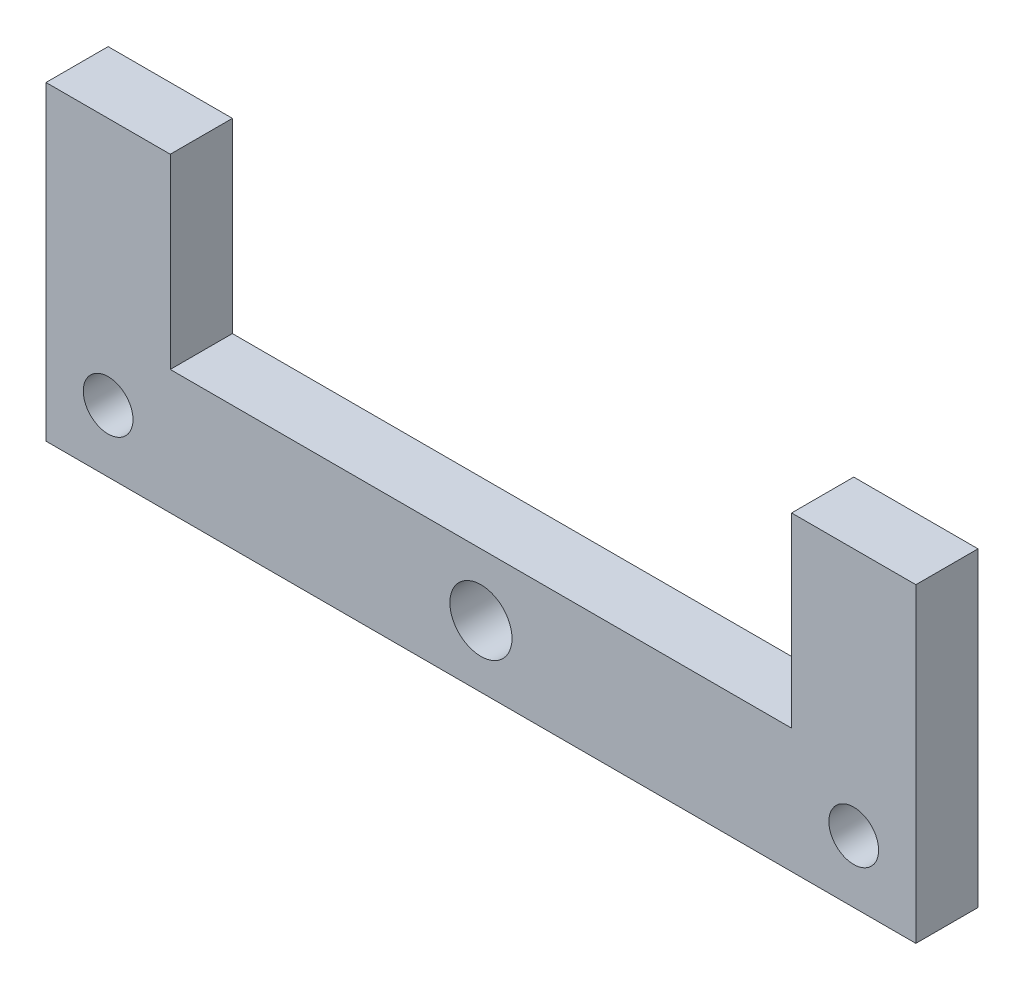
ISO-10303-21;
HEADER;
FILE_DESCRIPTION(('STEP AP214'),'2;1');
FILE_NAME('part.step','',(''),(''),'','','');
FILE_SCHEMA(('AUTOMOTIVE_DESIGN { 1 0 10303 214 1 1 1 1 }'));
ENDSEC;
DATA;
#1=APPLICATION_CONTEXT('core data for automotive mechanical design processes');
#2=APPLICATION_PROTOCOL_DEFINITION('international standard','automotive_design',2000,#1);
#3=PRODUCT_CONTEXT('',#1,'mechanical');
#4=PRODUCT('Part','Part','',(#3));
#5=PRODUCT_RELATED_PRODUCT_CATEGORY('part','',(#4));
#6=PRODUCT_DEFINITION_FORMATION('','',#4);
#7=PRODUCT_DEFINITION_CONTEXT('part definition',#1,'design');
#8=PRODUCT_DEFINITION('design','',#6,#7);
#9=PRODUCT_DEFINITION_SHAPE('','',#8);
#10=(LENGTH_UNIT() NAMED_UNIT(*) SI_UNIT(.MILLI.,.METRE.));
#11=(NAMED_UNIT(*) PLANE_ANGLE_UNIT() SI_UNIT($,.RADIAN.));
#12=(NAMED_UNIT(*) SI_UNIT($,.STERADIAN.) SOLID_ANGLE_UNIT());
#13=UNCERTAINTY_MEASURE_WITH_UNIT(LENGTH_MEASURE(1.E-05),#10,'distance_accuracy_value','');
#14=(GEOMETRIC_REPRESENTATION_CONTEXT(3) GLOBAL_UNCERTAINTY_ASSIGNED_CONTEXT((#13)) GLOBAL_UNIT_ASSIGNED_CONTEXT((#10,
#11,#12)) REPRESENTATION_CONTEXT('',''));
#15=CARTESIAN_POINT('',(0.,0.,0.));
#16=DIRECTION('',(0.,0.,1.));
#17=DIRECTION('',(1.,0.,0.));
#18=AXIS2_PLACEMENT_3D('',#15,#16,#17);
#19=CARTESIAN_POINT('',(50.,-100.772299585195,10.));
#20=DIRECTION('',(-1.,0.,0.));
#21=DIRECTION('',(0.,0.,1.));
#22=AXIS2_PLACEMENT_3D('',#19,#20,#21);
#23=PLANE('',#22);
#24=DIRECTION('',(0.,1.,0.));
#25=VECTOR('',#24,1.);
#26=CARTESIAN_POINT('',(50.,-100.772299585195,0.));
#27=LINE('',#26,#25);
#28=CARTESIAN_POINT('',(50.,9.99999999999998,0.));
#29=VERTEX_POINT('',#28);
#30=CARTESIAN_POINT('',(50.,40.,0.));
#31=VERTEX_POINT('',#30);
#32=EDGE_CURVE('E138',#29,#31,#27,.T.);
#33=ORIENTED_EDGE('',*,*,#32,.F.);
#34=DIRECTION('',(0.,0.,-1.));
#35=VECTOR('',#34,1.);
#36=CARTESIAN_POINT('',(50.,9.99999999999998,10.));
#37=LINE('',#36,#35);
#38=CARTESIAN_POINT('',(50.,9.99999999999998,10.));
#39=VERTEX_POINT('',#38);
#40=EDGE_CURVE('E11',#39,#29,#37,.T.);
#41=ORIENTED_EDGE('',*,*,#40,.F.);
#42=DIRECTION('',(0.,1.,0.));
#43=VECTOR('',#42,1.);
#44=CARTESIAN_POINT('',(50.,-100.772299585195,10.));
#45=LINE('',#44,#43);
#46=CARTESIAN_POINT('',(50.,40.,10.));
#47=VERTEX_POINT('',#46);
#48=EDGE_CURVE('E181',#39,#47,#45,.T.);
#49=ORIENTED_EDGE('',*,*,#48,.T.);
#50=DIRECTION('',(0.,0.,-1.));
#51=VECTOR('',#50,1.);
#52=CARTESIAN_POINT('',(50.,40.,10.));
#53=LINE('',#52,#51);
#54=EDGE_CURVE('E86',#47,#31,#53,.T.);
#55=ORIENTED_EDGE('',*,*,#54,.T.);
#56=EDGE_LOOP('',(#33,#41,#49,#55));
#57=FACE_BOUND('',#56,.T.);
#58=ADVANCED_FACE('F35',(#57),#23,.T.);
#59=CARTESIAN_POINT('',(0.,9.99999999999998,10.));
#60=DIRECTION('',(0.,1.,0.));
#61=DIRECTION('',(-1.,0.,0.));
#62=AXIS2_PLACEMENT_3D('',#59,#60,#61);
#63=PLANE('',#62);
#64=DIRECTION('',(1.,0.,0.));
#65=VECTOR('',#64,1.);
#66=CARTESIAN_POINT('',(0.,9.99999999999998,0.));
#67=LINE('',#66,#65);
#68=CARTESIAN_POINT('',(-50.,9.99999999999998,0.));
#69=VERTEX_POINT('',#68);
#70=EDGE_CURVE('E141',#69,#29,#67,.T.);
#71=ORIENTED_EDGE('',*,*,#70,.F.);
#72=DIRECTION('',(0.,0.,-1.));
#73=VECTOR('',#72,1.);
#74=CARTESIAN_POINT('',(-50.,9.99999999999998,10.));
#75=LINE('',#74,#73);
#76=CARTESIAN_POINT('',(-50.,9.99999999999998,10.));
#77=VERTEX_POINT('',#76);
#78=EDGE_CURVE('E44',#77,#69,#75,.T.);
#79=ORIENTED_EDGE('',*,*,#78,.F.);
#80=DIRECTION('',(1.,0.,0.));
#81=VECTOR('',#80,1.);
#82=CARTESIAN_POINT('',(0.,9.99999999999998,10.));
#83=LINE('',#82,#81);
#84=EDGE_CURVE('E179',#77,#39,#83,.T.);
#85=ORIENTED_EDGE('',*,*,#84,.T.);
#86=ORIENTED_EDGE('',*,*,#40,.T.);
#87=EDGE_LOOP('',(#71,#79,#85,#86));
#88=FACE_BOUND('',#87,.T.);
#89=ADVANCED_FACE('F178',(#88),#63,.T.);
#90=CARTESIAN_POINT('',(-50.,-100.772299585195,10.));
#91=DIRECTION('',(-1.,0.,0.));
#92=DIRECTION('',(0.,0.,1.));
#93=AXIS2_PLACEMENT_3D('',#90,#91,#92);
#94=PLANE('',#93);
#95=DIRECTION('',(0.,1.,0.));
#96=VECTOR('',#95,1.);
#97=CARTESIAN_POINT('',(-50.,-100.772299585195,0.));
#98=LINE('',#97,#96);
#99=CARTESIAN_POINT('',(-50.,40.,0.));
#100=VERTEX_POINT('',#99);
#101=EDGE_CURVE('E144',#69,#100,#98,.T.);
#102=ORIENTED_EDGE('',*,*,#101,.T.);
#103=DIRECTION('',(0.,0.,-1.));
#104=VECTOR('',#103,1.);
#105=CARTESIAN_POINT('',(-50.,40.,10.));
#106=LINE('',#105,#104);
#107=CARTESIAN_POINT('',(-50.,40.,10.));
#108=VERTEX_POINT('',#107);
#109=EDGE_CURVE('E164',#108,#100,#106,.T.);
#110=ORIENTED_EDGE('',*,*,#109,.F.);
#111=DIRECTION('',(0.,1.,0.));
#112=VECTOR('',#111,1.);
#113=CARTESIAN_POINT('',(-50.,-100.772299585195,10.));
#114=LINE('',#113,#112);
#115=EDGE_CURVE('E170',#77,#108,#114,.T.);
#116=ORIENTED_EDGE('',*,*,#115,.F.);
#117=ORIENTED_EDGE('',*,*,#78,.T.);
#118=EDGE_LOOP('',(#102,#110,#116,#117));
#119=FACE_BOUND('',#118,.T.);
#120=ADVANCED_FACE('F168',(#119),#94,.F.);
#121=CARTESIAN_POINT('',(0.,40.,10.));
#122=DIRECTION('',(0.,1.,0.));
#123=DIRECTION('',(0.,0.,1.));
#124=AXIS2_PLACEMENT_3D('',#121,#122,#123);
#125=PLANE('',#124);
#126=DIRECTION('',(1.,0.,0.));
#127=VECTOR('',#126,1.);
#128=CARTESIAN_POINT('',(0.,40.,0.));
#129=LINE('',#128,#127);
#130=CARTESIAN_POINT('',(-70.,40.,0.));
#131=VERTEX_POINT('',#130);
#132=EDGE_CURVE('E147',#131,#100,#129,.T.);
#133=ORIENTED_EDGE('',*,*,#132,.F.);
#134=DIRECTION('',(0.,0.,-1.));
#135=VECTOR('',#134,1.);
#136=CARTESIAN_POINT('',(-70.,40.,10.));
#137=LINE('',#136,#135);
#138=CARTESIAN_POINT('',(-70.,40.,10.));
#139=VERTEX_POINT('',#138);
#140=EDGE_CURVE('E162',#139,#131,#137,.T.);
#141=ORIENTED_EDGE('',*,*,#140,.F.);
#142=DIRECTION('',(1.,0.,0.));
#143=VECTOR('',#142,1.);
#144=CARTESIAN_POINT('',(0.,40.,10.));
#145=LINE('',#144,#143);
#146=EDGE_CURVE('E191',#139,#108,#145,.T.);
#147=ORIENTED_EDGE('',*,*,#146,.T.);
#148=ORIENTED_EDGE('',*,*,#109,.T.);
#149=EDGE_LOOP('',(#133,#141,#147,#148));
#150=FACE_BOUND('',#149,.T.);
#151=ADVANCED_FACE('F197',(#150),#125,.T.);
#152=CARTESIAN_POINT('',(-70.,-100.772299585195,10.));
#153=DIRECTION('',(-1.,0.,0.));
#154=DIRECTION('',(0.,0.,1.));
#155=AXIS2_PLACEMENT_3D('',#152,#153,#154);
#156=PLANE('',#155);
#157=DIRECTION('',(0.,1.,0.));
#158=VECTOR('',#157,1.);
#159=CARTESIAN_POINT('',(-70.,-100.772299585195,0.));
#160=LINE('',#159,#158);
#161=CARTESIAN_POINT('',(-70.,-10.,0.));
#162=VERTEX_POINT('',#161);
#163=EDGE_CURVE('E150',#162,#131,#160,.T.);
#164=ORIENTED_EDGE('',*,*,#163,.F.);
#165=DIRECTION('',(0.,0.,-1.));
#166=VECTOR('',#165,1.);
#167=CARTESIAN_POINT('',(-70.,-10.,10.));
#168=LINE('',#167,#166);
#169=CARTESIAN_POINT('',(-70.,-10.,10.));
#170=VERTEX_POINT('',#169);
#171=EDGE_CURVE('E122',#170,#162,#168,.T.);
#172=ORIENTED_EDGE('',*,*,#171,.F.);
#173=DIRECTION('',(0.,1.,0.));
#174=VECTOR('',#173,1.);
#175=CARTESIAN_POINT('',(-70.,-100.772299585195,10.));
#176=LINE('',#175,#174);
#177=EDGE_CURVE('E111',#170,#139,#176,.T.);
#178=ORIENTED_EDGE('',*,*,#177,.T.);
#179=ORIENTED_EDGE('',*,*,#140,.T.);
#180=EDGE_LOOP('',(#164,#172,#178,#179));
#181=FACE_BOUND('',#180,.T.);
#182=ADVANCED_FACE('F195',(#181),#156,.T.);
#183=CARTESIAN_POINT('',(0.,-10.,10.));
#184=DIRECTION('',(0.,1.,0.));
#185=DIRECTION('',(0.,0.,1.));
#186=AXIS2_PLACEMENT_3D('',#183,#184,#185);
#187=PLANE('',#186);
#188=DIRECTION('',(1.,0.,0.));
#189=VECTOR('',#188,1.);
#190=CARTESIAN_POINT('',(0.,-10.,0.));
#191=LINE('',#190,#189);
#192=CARTESIAN_POINT('',(70.,-10.,0.));
#193=VERTEX_POINT('',#192);
#194=EDGE_CURVE('E118',#162,#193,#191,.T.);
#195=ORIENTED_EDGE('',*,*,#194,.T.);
#196=DIRECTION('',(0.,0.,-1.));
#197=VECTOR('',#196,1.);
#198=CARTESIAN_POINT('',(70.,-10.,10.));
#199=LINE('',#198,#197);
#200=CARTESIAN_POINT('',(70.,-10.,10.));
#201=VERTEX_POINT('',#200);
#202=EDGE_CURVE('E115',#201,#193,#199,.T.);
#203=ORIENTED_EDGE('',*,*,#202,.F.);
#204=DIRECTION('',(1.,0.,0.));
#205=VECTOR('',#204,1.);
#206=CARTESIAN_POINT('',(0.,-10.,10.));
#207=LINE('',#206,#205);
#208=EDGE_CURVE('E104',#170,#201,#207,.T.);
#209=ORIENTED_EDGE('',*,*,#208,.F.);
#210=ORIENTED_EDGE('',*,*,#171,.T.);
#211=EDGE_LOOP('',(#195,#203,#209,#210));
#212=FACE_BOUND('',#211,.T.);
#213=ADVANCED_FACE('F116',(#212),#187,.F.);
#214=CARTESIAN_POINT('',(69.9999999999999,-100.772299585195,10.));
#215=DIRECTION('',(1.,0.,0.));
#216=DIRECTION('',(0.,1.,0.));
#217=AXIS2_PLACEMENT_3D('',#214,#215,#216);
#218=PLANE('',#217);
#219=DIRECTION('',(0.,-1.,0.));
#220=VECTOR('',#219,1.);
#221=CARTESIAN_POINT('',(69.9999999999999,-100.772299585195,0.));
#222=LINE('',#221,#220);
#223=CARTESIAN_POINT('',(70.,40.,0.));
#224=VERTEX_POINT('',#223);
#225=EDGE_CURVE('E154',#224,#193,#222,.T.);
#226=ORIENTED_EDGE('',*,*,#225,.F.);
#227=DIRECTION('',(0.,0.,-1.));
#228=VECTOR('',#227,1.);
#229=CARTESIAN_POINT('',(70.,40.,10.));
#230=LINE('',#229,#228);
#231=CARTESIAN_POINT('',(70.,40.,10.));
#232=VERTEX_POINT('',#231);
#233=EDGE_CURVE('E79',#232,#224,#230,.T.);
#234=ORIENTED_EDGE('',*,*,#233,.F.);
#235=DIRECTION('',(0.,-1.,0.));
#236=VECTOR('',#235,1.);
#237=CARTESIAN_POINT('',(69.9999999999999,-100.772299585195,10.));
#238=LINE('',#237,#236);
#239=EDGE_CURVE('E108',#232,#201,#238,.T.);
#240=ORIENTED_EDGE('',*,*,#239,.T.);
#241=ORIENTED_EDGE('',*,*,#202,.T.);
#242=EDGE_LOOP('',(#226,#234,#240,#241));
#243=FACE_BOUND('',#242,.T.);
#244=ADVANCED_FACE('F124',(#243),#218,.T.);
#245=CARTESIAN_POINT('',(0.,0.,10.));
#246=DIRECTION('',(0.,0.,-1.));
#247=DIRECTION('',(-1.,0.,0.));
#248=AXIS2_PLACEMENT_3D('',#245,#246,#247);
#249=CYLINDRICAL_SURFACE('',#248,5.);
#250=CARTESIAN_POINT('',(0.,0.,10.));
#251=DIRECTION('',(0.,0.,1.));
#252=DIRECTION('',(1.,0.,0.));
#253=AXIS2_PLACEMENT_3D('',#250,#251,#252);
#254=CIRCLE('',#253,5.);
#255=CARTESIAN_POINT('',(5.,0.,10.));
#256=VERTEX_POINT('',#255);
#257=EDGE_CURVE('E182',#256,#256,#254,.T.);
#258=ORIENTED_EDGE('',*,*,#257,.T.);
#259=EDGE_LOOP('',(#258));
#260=FACE_BOUND('',#259,.T.);
#261=CARTESIAN_POINT('',(0.,0.,0.));
#262=DIRECTION('',(0.,0.,1.));
#263=DIRECTION('',(1.,0.,0.));
#264=AXIS2_PLACEMENT_3D('',#261,#262,#263);
#265=CIRCLE('',#264,5.);
#266=CARTESIAN_POINT('',(5.,0.,0.));
#267=VERTEX_POINT('',#266);
#268=EDGE_CURVE('E135',#267,#267,#265,.T.);
#269=ORIENTED_EDGE('',*,*,#268,.F.);
#270=EDGE_LOOP('',(#269));
#271=FACE_BOUND('',#270,.T.);
#272=ADVANCED_FACE('F213',(#260,#271),#249,.F.);
#273=CARTESIAN_POINT('',(-60.,0.,10.));
#274=DIRECTION('',(0.,0.,-1.));
#275=DIRECTION('',(-1.,0.,0.));
#276=AXIS2_PLACEMENT_3D('',#273,#274,#275);
#277=CYLINDRICAL_SURFACE('',#276,3.99999999999999);
#278=CARTESIAN_POINT('',(-60.,0.,10.));
#279=DIRECTION('',(0.,0.,1.));
#280=DIRECTION('',(1.,0.,0.));
#281=AXIS2_PLACEMENT_3D('',#278,#279,#280);
#282=CIRCLE('',#281,3.99999999999999);
#283=CARTESIAN_POINT('',(-56.,0.,10.));
#284=VERTEX_POINT('',#283);
#285=EDGE_CURVE('E186',#284,#284,#282,.T.);
#286=ORIENTED_EDGE('',*,*,#285,.T.);
#287=EDGE_LOOP('',(#286));
#288=FACE_BOUND('',#287,.T.);
#289=CARTESIAN_POINT('',(-60.,0.,0.));
#290=DIRECTION('',(0.,0.,1.));
#291=DIRECTION('',(1.,0.,0.));
#292=AXIS2_PLACEMENT_3D('',#289,#290,#291);
#293=CIRCLE('',#292,3.99999999999999);
#294=CARTESIAN_POINT('',(-56.,0.,0.));
#295=VERTEX_POINT('',#294);
#296=EDGE_CURVE('E132',#295,#295,#293,.T.);
#297=ORIENTED_EDGE('',*,*,#296,.F.);
#298=EDGE_LOOP('',(#297));
#299=FACE_BOUND('',#298,.T.);
#300=ADVANCED_FACE('F215',(#288,#299),#277,.F.);
#301=CARTESIAN_POINT('',(60.,0.,10.));
#302=DIRECTION('',(0.,0.,-1.));
#303=DIRECTION('',(-1.,0.,0.));
#304=AXIS2_PLACEMENT_3D('',#301,#302,#303);
#305=CYLINDRICAL_SURFACE('',#304,4.00000000000001);
#306=CARTESIAN_POINT('',(60.,0.,10.));
#307=DIRECTION('',(0.,0.,1.));
#308=DIRECTION('',(1.,0.,0.));
#309=AXIS2_PLACEMENT_3D('',#306,#307,#308);
#310=CIRCLE('',#309,4.00000000000001);
#311=CARTESIAN_POINT('',(64.,0.,10.));
#312=VERTEX_POINT('',#311);
#313=EDGE_CURVE('E158',#312,#312,#310,.T.);
#314=ORIENTED_EDGE('',*,*,#313,.T.);
#315=EDGE_LOOP('',(#314));
#316=FACE_BOUND('',#315,.T.);
#317=CARTESIAN_POINT('',(60.,0.,0.));
#318=DIRECTION('',(0.,0.,1.));
#319=DIRECTION('',(1.,0.,0.));
#320=AXIS2_PLACEMENT_3D('',#317,#318,#319);
#321=CIRCLE('',#320,4.00000000000001);
#322=CARTESIAN_POINT('',(64.,0.,0.));
#323=VERTEX_POINT('',#322);
#324=EDGE_CURVE('E129',#323,#323,#321,.T.);
#325=ORIENTED_EDGE('',*,*,#324,.F.);
#326=EDGE_LOOP('',(#325));
#327=FACE_BOUND('',#326,.T.);
#328=ADVANCED_FACE('F37',(#316,#327),#305,.F.);
#329=CARTESIAN_POINT('',(0.,40.,10.));
#330=DIRECTION('',(0.,-1.,0.));
#331=DIRECTION('',(0.,0.,-1.));
#332=AXIS2_PLACEMENT_3D('',#329,#330,#331);
#333=PLANE('',#332);
#334=DIRECTION('',(-1.,0.,0.));
#335=VECTOR('',#334,1.);
#336=CARTESIAN_POINT('',(0.,40.,0.));
#337=LINE('',#336,#335);
#338=EDGE_CURVE('E156',#224,#31,#337,.T.);
#339=ORIENTED_EDGE('',*,*,#338,.T.);
#340=ORIENTED_EDGE('',*,*,#54,.F.);
#341=DIRECTION('',(-1.,0.,0.));
#342=VECTOR('',#341,1.);
#343=CARTESIAN_POINT('',(0.,40.,10.));
#344=LINE('',#343,#342);
#345=EDGE_CURVE('E52',#232,#47,#344,.T.);
#346=ORIENTED_EDGE('',*,*,#345,.F.);
#347=ORIENTED_EDGE('',*,*,#233,.T.);
#348=EDGE_LOOP('',(#339,#340,#346,#347));
#349=FACE_BOUND('',#348,.T.);
#350=ADVANCED_FACE('F180',(#349),#333,.F.);
#351=CARTESIAN_POINT('',(0.,-100.772299585195,10.));
#352=DIRECTION('',(0.,0.,1.));
#353=DIRECTION('',(1.,0.,0.));
#354=AXIS2_PLACEMENT_3D('',#351,#352,#353);
#355=PLANE('',#354);
#356=ORIENTED_EDGE('',*,*,#313,.F.);
#357=EDGE_LOOP('',(#356));
#358=FACE_BOUND('',#357,.T.);
#359=ORIENTED_EDGE('',*,*,#285,.F.);
#360=EDGE_LOOP('',(#359));
#361=FACE_BOUND('',#360,.T.);
#362=ORIENTED_EDGE('',*,*,#257,.F.);
#363=EDGE_LOOP('',(#362));
#364=FACE_BOUND('',#363,.T.);
#365=ORIENTED_EDGE('',*,*,#48,.F.);
#366=ORIENTED_EDGE('',*,*,#84,.F.);
#367=ORIENTED_EDGE('',*,*,#115,.T.);
#368=ORIENTED_EDGE('',*,*,#146,.F.);
#369=ORIENTED_EDGE('',*,*,#177,.F.);
#370=ORIENTED_EDGE('',*,*,#208,.T.);
#371=ORIENTED_EDGE('',*,*,#239,.F.);
#372=ORIENTED_EDGE('',*,*,#345,.T.);
#373=EDGE_LOOP('',(#365,#366,#367,#368,#369,#370,#371,#372));
#374=FACE_BOUND('',#373,.T.);
#375=ADVANCED_FACE('F106',(#358,#361,#364,#374),#355,.T.);
#376=CARTESIAN_POINT('',(0.,-100.772299585195,0.));
#377=DIRECTION('',(0.,0.,1.));
#378=DIRECTION('',(1.,0.,0.));
#379=AXIS2_PLACEMENT_3D('',#376,#377,#378);
#380=PLANE('',#379);
#381=ORIENTED_EDGE('',*,*,#324,.T.);
#382=EDGE_LOOP('',(#381));
#383=FACE_BOUND('',#382,.T.);
#384=ORIENTED_EDGE('',*,*,#296,.T.);
#385=EDGE_LOOP('',(#384));
#386=FACE_BOUND('',#385,.T.);
#387=ORIENTED_EDGE('',*,*,#268,.T.);
#388=EDGE_LOOP('',(#387));
#389=FACE_BOUND('',#388,.T.);
#390=ORIENTED_EDGE('',*,*,#32,.T.);
#391=ORIENTED_EDGE('',*,*,#338,.F.);
#392=ORIENTED_EDGE('',*,*,#225,.T.);
#393=ORIENTED_EDGE('',*,*,#194,.F.);
#394=ORIENTED_EDGE('',*,*,#163,.T.);
#395=ORIENTED_EDGE('',*,*,#132,.T.);
#396=ORIENTED_EDGE('',*,*,#101,.F.);
#397=ORIENTED_EDGE('',*,*,#70,.T.);
#398=EDGE_LOOP('',(#390,#391,#392,#393,#394,#395,#396,#397));
#399=FACE_BOUND('',#398,.T.);
#400=ADVANCED_FACE('F176',(#383,#386,#389,#399),#380,.F.);
#401=CLOSED_SHELL('',(#58,#89,#120,#151,#182,#213,#244,#272,#300,#328,#350,#375,#400));
#402=MANIFOLD_SOLID_BREP('B2',#401);
#403=ADVANCED_BREP_SHAPE_REPRESENTATION('',(#18,#402),#14);
#404=SHAPE_DEFINITION_REPRESENTATION(#9,#403);
ENDSEC;
END-ISO-10303-21;
